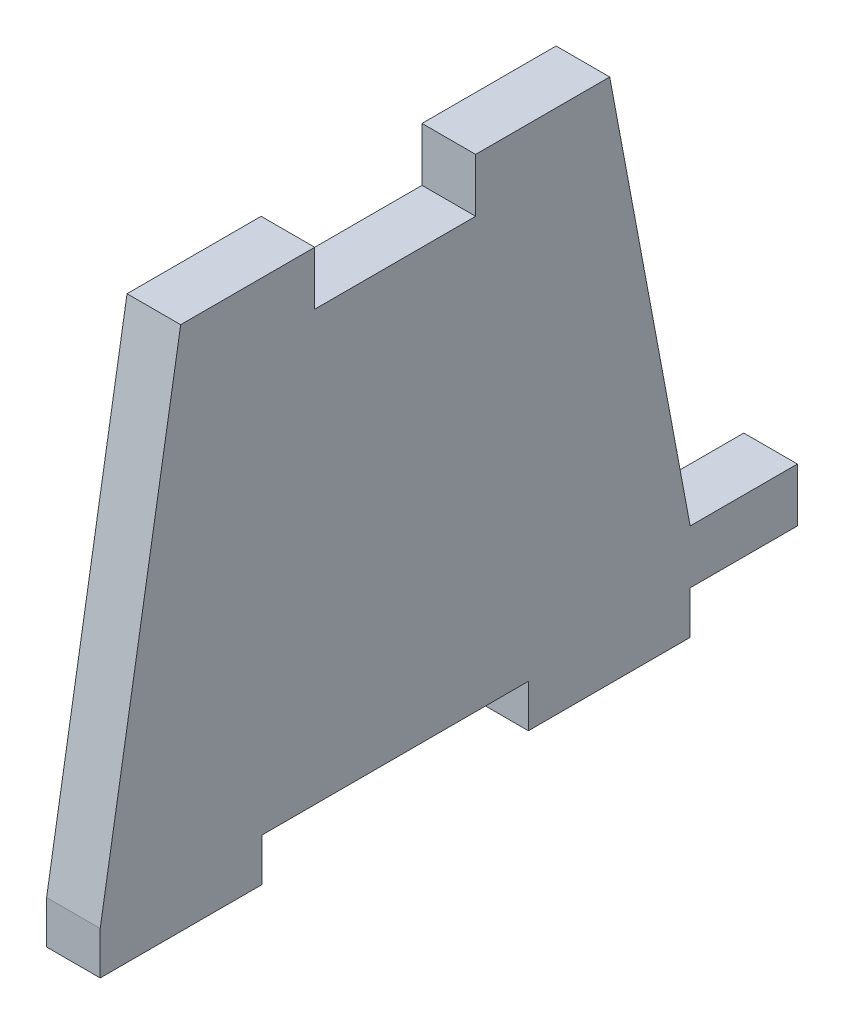
ISO-10303-21;
HEADER;
FILE_DESCRIPTION(('STEP AP214'),'2;1');
FILE_NAME('part.step','',(''),(''),'','','');
FILE_SCHEMA(('AUTOMOTIVE_DESIGN { 1 0 10303 214 1 1 1 1 }'));
ENDSEC;
DATA;
#1=APPLICATION_CONTEXT('core data for automotive mechanical design processes');
#2=APPLICATION_PROTOCOL_DEFINITION('international standard','automotive_design',2000,#1);
#3=PRODUCT_CONTEXT('',#1,'mechanical');
#4=PRODUCT('Part','Part','',(#3));
#5=PRODUCT_RELATED_PRODUCT_CATEGORY('part','',(#4));
#6=PRODUCT_DEFINITION_FORMATION('','',#4);
#7=PRODUCT_DEFINITION_CONTEXT('part definition',#1,'design');
#8=PRODUCT_DEFINITION('design','',#6,#7);
#9=PRODUCT_DEFINITION_SHAPE('','',#8);
#10=(LENGTH_UNIT() NAMED_UNIT(*) SI_UNIT(.MILLI.,.METRE.));
#11=(NAMED_UNIT(*) PLANE_ANGLE_UNIT() SI_UNIT($,.RADIAN.));
#12=(NAMED_UNIT(*) SI_UNIT($,.STERADIAN.) SOLID_ANGLE_UNIT());
#13=UNCERTAINTY_MEASURE_WITH_UNIT(LENGTH_MEASURE(1.E-05),#10,'distance_accuracy_value','');
#14=(GEOMETRIC_REPRESENTATION_CONTEXT(3) GLOBAL_UNCERTAINTY_ASSIGNED_CONTEXT((#13)) GLOBAL_UNIT_ASSIGNED_CONTEXT((#10,
#11,#12)) REPRESENTATION_CONTEXT('',''));
#15=CARTESIAN_POINT('',(0.,0.,0.));
#16=DIRECTION('',(0.,0.,1.));
#17=DIRECTION('',(1.,0.,0.));
#18=AXIS2_PLACEMENT_3D('',#15,#16,#17);
#19=CARTESIAN_POINT('',(1.5875,28.575,4.7625));
#20=DIRECTION('',(0.,-1.,0.));
#21=DIRECTION('',(0.,0.,-1.));
#22=AXIS2_PLACEMENT_3D('',#19,#20,#21);
#23=PLANE('',#22);
#24=DIRECTION('',(0.,0.,1.));
#25=VECTOR('',#24,1.);
#26=CARTESIAN_POINT('',(-1.5875,28.575,4.7625));
#27=LINE('',#26,#25);
#28=CARTESIAN_POINT('',(-1.5875,28.575,4.7625));
#29=VERTEX_POINT('',#28);
#30=CARTESIAN_POINT('',(-1.5875,28.575,12.7));
#31=VERTEX_POINT('',#30);
#32=EDGE_CURVE('E181',#29,#31,#27,.T.);
#33=ORIENTED_EDGE('',*,*,#32,.T.);
#34=DIRECTION('',(-1.,0.,0.));
#35=VECTOR('',#34,1.);
#36=CARTESIAN_POINT('',(1.5875,28.575,12.7));
#37=LINE('',#36,#35);
#38=CARTESIAN_POINT('',(1.5875,28.575,12.7));
#39=VERTEX_POINT('',#38);
#40=EDGE_CURVE('E11',#39,#31,#37,.T.);
#41=ORIENTED_EDGE('',*,*,#40,.F.);
#42=DIRECTION('',(0.,0.,1.));
#43=VECTOR('',#42,1.);
#44=CARTESIAN_POINT('',(1.5875,28.575,4.7625));
#45=LINE('',#44,#43);
#46=CARTESIAN_POINT('',(1.5875,28.575,4.7625));
#47=VERTEX_POINT('',#46);
#48=EDGE_CURVE('E215',#47,#39,#45,.T.);
#49=ORIENTED_EDGE('',*,*,#48,.F.);
#50=DIRECTION('',(-1.,0.,0.));
#51=VECTOR('',#50,1.);
#52=CARTESIAN_POINT('',(1.5875,28.575,4.7625));
#53=LINE('',#52,#51);
#54=EDGE_CURVE('E177',#47,#29,#53,.T.);
#55=ORIENTED_EDGE('',*,*,#54,.T.);
#56=EDGE_LOOP('',(#33,#41,#49,#55));
#57=FACE_BOUND('',#56,.T.);
#58=ADVANCED_FACE('F33',(#57),#23,.F.);
#59=CARTESIAN_POINT('',(1.5875,28.575,12.7));
#60=DIRECTION('',(0.,-0.164398987305357,-0.986393923832144));
#61=DIRECTION('',(0.,0.986393923832144,-0.164398987305357));
#62=AXIS2_PLACEMENT_3D('',#59,#60,#61);
#63=PLANE('',#62);
#64=DIRECTION('',(0.,-0.986393923832144,0.164398987305357));
#65=VECTOR('',#64,1.);
#66=CARTESIAN_POINT('',(-1.5875,28.575,12.7));
#67=LINE('',#66,#65);
#68=CARTESIAN_POINT('',(-1.5875,0.,17.4625));
#69=VERTEX_POINT('',#68);
#70=EDGE_CURVE('E184',#31,#69,#67,.T.);
#71=ORIENTED_EDGE('',*,*,#70,.T.);
#72=DIRECTION('',(-1.,0.,0.));
#73=VECTOR('',#72,1.);
#74=CARTESIAN_POINT('',(1.5875,0.,17.4625));
#75=LINE('',#74,#73);
#76=CARTESIAN_POINT('',(1.5875,0.,17.4625));
#77=VERTEX_POINT('',#76);
#78=EDGE_CURVE('E41',#77,#69,#75,.T.);
#79=ORIENTED_EDGE('',*,*,#78,.F.);
#80=DIRECTION('',(0.,-0.986393923832144,0.164398987305357));
#81=VECTOR('',#80,1.);
#82=CARTESIAN_POINT('',(1.5875,28.575,12.7));
#83=LINE('',#82,#81);
#84=EDGE_CURVE('E115',#39,#77,#83,.T.);
#85=ORIENTED_EDGE('',*,*,#84,.F.);
#86=ORIENTED_EDGE('',*,*,#40,.T.);
#87=EDGE_LOOP('',(#71,#79,#85,#86));
#88=FACE_BOUND('',#87,.T.);
#89=ADVANCED_FACE('F318',(#88),#63,.F.);
#90=CARTESIAN_POINT('',(1.5875,0.,17.4625));
#91=DIRECTION('',(0.,0.,-1.));
#92=DIRECTION('',(-1.,0.,0.));
#93=AXIS2_PLACEMENT_3D('',#90,#91,#92);
#94=PLANE('',#93);
#95=DIRECTION('',(0.,-1.,0.));
#96=VECTOR('',#95,1.);
#97=CARTESIAN_POINT('',(-1.5875,0.,17.4625));
#98=LINE('',#97,#96);
#99=CARTESIAN_POINT('',(-1.5875,-2.54,17.4625));
#100=VERTEX_POINT('',#99);
#101=EDGE_CURVE('E186',#69,#100,#98,.T.);
#102=ORIENTED_EDGE('',*,*,#101,.T.);
#103=DIRECTION('',(-1.,0.,0.));
#104=VECTOR('',#103,1.);
#105=CARTESIAN_POINT('',(1.5875,-2.54,17.4625));
#106=LINE('',#105,#104);
#107=CARTESIAN_POINT('',(1.5875,-2.54,17.4625));
#108=VERTEX_POINT('',#107);
#109=EDGE_CURVE('E249',#108,#100,#106,.T.);
#110=ORIENTED_EDGE('',*,*,#109,.F.);
#111=DIRECTION('',(0.,-1.,0.));
#112=VECTOR('',#111,1.);
#113=CARTESIAN_POINT('',(1.5875,0.,17.4625));
#114=LINE('',#113,#112);
#115=EDGE_CURVE('E257',#77,#108,#114,.T.);
#116=ORIENTED_EDGE('',*,*,#115,.F.);
#117=ORIENTED_EDGE('',*,*,#78,.T.);
#118=EDGE_LOOP('',(#102,#110,#116,#117));
#119=FACE_BOUND('',#118,.T.);
#120=ADVANCED_FACE('F255',(#119),#94,.F.);
#121=CARTESIAN_POINT('',(1.5875,-2.54,17.4625));
#122=DIRECTION('',(0.,1.,0.));
#123=DIRECTION('',(0.,0.,1.));
#124=AXIS2_PLACEMENT_3D('',#121,#122,#123);
#125=PLANE('',#124);
#126=DIRECTION('',(0.,0.,-1.));
#127=VECTOR('',#126,1.);
#128=CARTESIAN_POINT('',(-1.5875,-2.54,17.4625));
#129=LINE('',#128,#127);
#130=CARTESIAN_POINT('',(-1.5875,-2.54,7.8867));
#131=VERTEX_POINT('',#130);
#132=EDGE_CURVE('E188',#100,#131,#129,.T.);
#133=ORIENTED_EDGE('',*,*,#132,.T.);
#134=DIRECTION('',(-1.,0.,0.));
#135=VECTOR('',#134,1.);
#136=CARTESIAN_POINT('',(1.5875,-2.54,7.8867));
#137=LINE('',#136,#135);
#138=CARTESIAN_POINT('',(1.5875,-2.54,7.8867));
#139=VERTEX_POINT('',#138);
#140=EDGE_CURVE('E246',#139,#131,#137,.T.);
#141=ORIENTED_EDGE('',*,*,#140,.F.);
#142=DIRECTION('',(0.,0.,-1.));
#143=VECTOR('',#142,1.);
#144=CARTESIAN_POINT('',(1.5875,-2.54,17.4625));
#145=LINE('',#144,#143);
#146=EDGE_CURVE('E275',#108,#139,#145,.T.);
#147=ORIENTED_EDGE('',*,*,#146,.F.);
#148=ORIENTED_EDGE('',*,*,#109,.T.);
#149=EDGE_LOOP('',(#133,#141,#147,#148));
#150=FACE_BOUND('',#149,.T.);
#151=ADVANCED_FACE('F266',(#150),#125,.F.);
#152=CARTESIAN_POINT('',(1.5875,-2.54,7.8867));
#153=DIRECTION('',(0.,0.,1.));
#154=DIRECTION('',(0.,-1.,0.));
#155=AXIS2_PLACEMENT_3D('',#152,#153,#154);
#156=PLANE('',#155);
#157=DIRECTION('',(0.,1.,0.));
#158=VECTOR('',#157,1.);
#159=CARTESIAN_POINT('',(-1.5875,-2.54,7.8867));
#160=LINE('',#159,#158);
#161=CARTESIAN_POINT('',(-1.5875,0.,7.8867));
#162=VERTEX_POINT('',#161);
#163=EDGE_CURVE('E190',#131,#162,#160,.T.);
#164=ORIENTED_EDGE('',*,*,#163,.T.);
#165=DIRECTION('',(-1.,0.,0.));
#166=VECTOR('',#165,1.);
#167=CARTESIAN_POINT('',(1.5875,0.,7.8867));
#168=LINE('',#167,#166);
#169=CARTESIAN_POINT('',(1.5875,0.,7.8867));
#170=VERTEX_POINT('',#169);
#171=EDGE_CURVE('E243',#170,#162,#168,.T.);
#172=ORIENTED_EDGE('',*,*,#171,.F.);
#173=DIRECTION('',(0.,1.,0.));
#174=VECTOR('',#173,1.);
#175=CARTESIAN_POINT('',(1.5875,-2.54,7.8867));
#176=LINE('',#175,#174);
#177=EDGE_CURVE('E272',#139,#170,#176,.T.);
#178=ORIENTED_EDGE('',*,*,#177,.F.);
#179=ORIENTED_EDGE('',*,*,#140,.T.);
#180=EDGE_LOOP('',(#164,#172,#178,#179));
#181=FACE_BOUND('',#180,.T.);
#182=ADVANCED_FACE('F270',(#181),#156,.F.);
#183=CARTESIAN_POINT('',(1.5875,0.,7.8867));
#184=DIRECTION('',(0.,1.,0.));
#185=DIRECTION('',(0.,0.,1.));
#186=AXIS2_PLACEMENT_3D('',#183,#184,#185);
#187=PLANE('',#186);
#188=DIRECTION('',(0.,0.,-1.));
#189=VECTOR('',#188,1.);
#190=CARTESIAN_POINT('',(-1.5875,0.,7.8867));
#191=LINE('',#190,#189);
#192=CARTESIAN_POINT('',(-1.5875,0.,-7.8867));
#193=VERTEX_POINT('',#192);
#194=EDGE_CURVE('E192',#162,#193,#191,.T.);
#195=ORIENTED_EDGE('',*,*,#194,.T.);
#196=DIRECTION('',(-1.,0.,0.));
#197=VECTOR('',#196,1.);
#198=CARTESIAN_POINT('',(1.5875,0.,-7.8867));
#199=LINE('',#198,#197);
#200=CARTESIAN_POINT('',(1.5875,0.,-7.8867));
#201=VERTEX_POINT('',#200);
#202=EDGE_CURVE('E240',#201,#193,#199,.T.);
#203=ORIENTED_EDGE('',*,*,#202,.F.);
#204=DIRECTION('',(0.,0.,-1.));
#205=VECTOR('',#204,1.);
#206=CARTESIAN_POINT('',(1.5875,0.,7.8867));
#207=LINE('',#206,#205);
#208=EDGE_CURVE('E274',#170,#201,#207,.T.);
#209=ORIENTED_EDGE('',*,*,#208,.F.);
#210=ORIENTED_EDGE('',*,*,#171,.T.);
#211=EDGE_LOOP('',(#195,#203,#209,#210));
#212=FACE_BOUND('',#211,.T.);
#213=ADVANCED_FACE('F331',(#212),#187,.F.);
#214=CARTESIAN_POINT('',(1.5875,0.,-7.8867));
#215=DIRECTION('',(0.,0.,-1.));
#216=DIRECTION('',(0.,1.,0.));
#217=AXIS2_PLACEMENT_3D('',#214,#215,#216);
#218=PLANE('',#217);
#219=DIRECTION('',(0.,-1.,0.));
#220=VECTOR('',#219,1.);
#221=CARTESIAN_POINT('',(-1.5875,0.,-7.8867));
#222=LINE('',#221,#220);
#223=CARTESIAN_POINT('',(-1.5875,-2.54,-7.8867));
#224=VERTEX_POINT('',#223);
#225=EDGE_CURVE('E194',#193,#224,#222,.T.);
#226=ORIENTED_EDGE('',*,*,#225,.T.);
#227=DIRECTION('',(-1.,0.,0.));
#228=VECTOR('',#227,1.);
#229=CARTESIAN_POINT('',(1.5875,-2.54,-7.8867));
#230=LINE('',#229,#228);
#231=CARTESIAN_POINT('',(1.5875,-2.54,-7.8867));
#232=VERTEX_POINT('',#231);
#233=EDGE_CURVE('E237',#232,#224,#230,.T.);
#234=ORIENTED_EDGE('',*,*,#233,.F.);
#235=DIRECTION('',(0.,-1.,0.));
#236=VECTOR('',#235,1.);
#237=CARTESIAN_POINT('',(1.5875,0.,-7.8867));
#238=LINE('',#237,#236);
#239=EDGE_CURVE('E277',#201,#232,#238,.T.);
#240=ORIENTED_EDGE('',*,*,#239,.F.);
#241=ORIENTED_EDGE('',*,*,#202,.T.);
#242=EDGE_LOOP('',(#226,#234,#240,#241));
#243=FACE_BOUND('',#242,.T.);
#244=ADVANCED_FACE('F334',(#243),#218,.F.);
#245=CARTESIAN_POINT('',(1.5875,-2.54,-7.8867));
#246=DIRECTION('',(0.,1.,0.));
#247=DIRECTION('',(0.,0.,1.));
#248=AXIS2_PLACEMENT_3D('',#245,#246,#247);
#249=PLANE('',#248);
#250=DIRECTION('',(0.,0.,-1.));
#251=VECTOR('',#250,1.);
#252=CARTESIAN_POINT('',(-1.5875,-2.54,-7.8867));
#253=LINE('',#252,#251);
#254=CARTESIAN_POINT('',(-1.5875,-2.54,-17.4625));
#255=VERTEX_POINT('',#254);
#256=EDGE_CURVE('E196',#224,#255,#253,.T.);
#257=ORIENTED_EDGE('',*,*,#256,.T.);
#258=DIRECTION('',(-1.,0.,0.));
#259=VECTOR('',#258,1.);
#260=CARTESIAN_POINT('',(1.5875,-2.54,-17.4625));
#261=LINE('',#260,#259);
#262=CARTESIAN_POINT('',(1.5875,-2.54,-17.4625));
#263=VERTEX_POINT('',#262);
#264=EDGE_CURVE('E234',#263,#255,#261,.T.);
#265=ORIENTED_EDGE('',*,*,#264,.F.);
#266=DIRECTION('',(0.,0.,-1.));
#267=VECTOR('',#266,1.);
#268=CARTESIAN_POINT('',(1.5875,-2.54,-7.8867));
#269=LINE('',#268,#267);
#270=EDGE_CURVE('E283',#232,#263,#269,.T.);
#271=ORIENTED_EDGE('',*,*,#270,.F.);
#272=ORIENTED_EDGE('',*,*,#233,.T.);
#273=EDGE_LOOP('',(#257,#265,#271,#272));
#274=FACE_BOUND('',#273,.T.);
#275=ADVANCED_FACE('F338',(#274),#249,.F.);
#276=CARTESIAN_POINT('',(1.5875,-2.54,-17.4625));
#277=DIRECTION('',(0.,0.,1.));
#278=DIRECTION('',(1.,0.,0.));
#279=AXIS2_PLACEMENT_3D('',#276,#277,#278);
#280=PLANE('',#279);
#281=DIRECTION('',(0.,1.,0.));
#282=VECTOR('',#281,1.);
#283=CARTESIAN_POINT('',(-1.5875,-2.54,-17.4625));
#284=LINE('',#283,#282);
#285=CARTESIAN_POINT('',(-1.5875,0.,-17.4625));
#286=VERTEX_POINT('',#285);
#287=EDGE_CURVE('E198',#255,#286,#284,.T.);
#288=ORIENTED_EDGE('',*,*,#287,.T.);
#289=DIRECTION('',(-1.,0.,0.));
#290=VECTOR('',#289,1.);
#291=CARTESIAN_POINT('',(1.5875,0.,-17.4625));
#292=LINE('',#291,#290);
#293=CARTESIAN_POINT('',(1.5875,0.,-17.4625));
#294=VERTEX_POINT('',#293);
#295=EDGE_CURVE('E231',#294,#286,#292,.T.);
#296=ORIENTED_EDGE('',*,*,#295,.F.);
#297=DIRECTION('',(0.,1.,0.));
#298=VECTOR('',#297,1.);
#299=CARTESIAN_POINT('',(1.5875,-2.54,-17.4625));
#300=LINE('',#299,#298);
#301=EDGE_CURVE('E285',#263,#294,#300,.T.);
#302=ORIENTED_EDGE('',*,*,#301,.F.);
#303=ORIENTED_EDGE('',*,*,#264,.T.);
#304=EDGE_LOOP('',(#288,#296,#302,#303));
#305=FACE_BOUND('',#304,.T.);
#306=ADVANCED_FACE('F342',(#305),#280,.F.);
#307=CARTESIAN_POINT('',(1.5875,0.,-17.4625));
#308=DIRECTION('',(0.,1.,0.));
#309=DIRECTION('',(0.,0.,1.));
#310=AXIS2_PLACEMENT_3D('',#307,#308,#309);
#311=PLANE('',#310);
#312=DIRECTION('',(0.,0.,-1.));
#313=VECTOR('',#312,1.);
#314=CARTESIAN_POINT('',(-1.5875,0.,-17.4625));
#315=LINE('',#314,#313);
#316=CARTESIAN_POINT('',(-1.5875,0.,-23.8125));
#317=VERTEX_POINT('',#316);
#318=EDGE_CURVE('E200',#286,#317,#315,.T.);
#319=ORIENTED_EDGE('',*,*,#318,.T.);
#320=DIRECTION('',(-1.,0.,0.));
#321=VECTOR('',#320,1.);
#322=CARTESIAN_POINT('',(1.5875,0.,-23.8125));
#323=LINE('',#322,#321);
#324=CARTESIAN_POINT('',(1.5875,0.,-23.8125));
#325=VERTEX_POINT('',#324);
#326=EDGE_CURVE('E228',#325,#317,#323,.T.);
#327=ORIENTED_EDGE('',*,*,#326,.F.);
#328=DIRECTION('',(0.,0.,-1.));
#329=VECTOR('',#328,1.);
#330=CARTESIAN_POINT('',(1.5875,0.,-17.4625));
#331=LINE('',#330,#329);
#332=EDGE_CURVE('E287',#294,#325,#331,.T.);
#333=ORIENTED_EDGE('',*,*,#332,.F.);
#334=ORIENTED_EDGE('',*,*,#295,.T.);
#335=EDGE_LOOP('',(#319,#327,#333,#334));
#336=FACE_BOUND('',#335,.T.);
#337=ADVANCED_FACE('F346',(#336),#311,.F.);
#338=CARTESIAN_POINT('',(1.5875,0.,-23.8125));
#339=DIRECTION('',(0.,0.,1.));
#340=DIRECTION('',(1.,0.,0.));
#341=AXIS2_PLACEMENT_3D('',#338,#339,#340);
#342=PLANE('',#341);
#343=DIRECTION('',(0.,1.,0.));
#344=VECTOR('',#343,1.);
#345=CARTESIAN_POINT('',(-1.5875,0.,-23.8125));
#346=LINE('',#345,#344);
#347=CARTESIAN_POINT('',(-1.5875,3.175,-23.8125));
#348=VERTEX_POINT('',#347);
#349=EDGE_CURVE('E202',#317,#348,#346,.T.);
#350=ORIENTED_EDGE('',*,*,#349,.T.);
#351=DIRECTION('',(-1.,0.,0.));
#352=VECTOR('',#351,1.);
#353=CARTESIAN_POINT('',(1.5875,3.175,-23.8125));
#354=LINE('',#353,#352);
#355=CARTESIAN_POINT('',(1.5875,3.175,-23.8125));
#356=VERTEX_POINT('',#355);
#357=EDGE_CURVE('E225',#356,#348,#354,.T.);
#358=ORIENTED_EDGE('',*,*,#357,.F.);
#359=DIRECTION('',(0.,1.,0.));
#360=VECTOR('',#359,1.);
#361=CARTESIAN_POINT('',(1.5875,0.,-23.8125));
#362=LINE('',#361,#360);
#363=EDGE_CURVE('E289',#325,#356,#362,.T.);
#364=ORIENTED_EDGE('',*,*,#363,.F.);
#365=ORIENTED_EDGE('',*,*,#326,.T.);
#366=EDGE_LOOP('',(#350,#358,#364,#365));
#367=FACE_BOUND('',#366,.T.);
#368=ADVANCED_FACE('F350',(#367),#342,.F.);
#369=CARTESIAN_POINT('',(1.5875,3.175,-23.8125));
#370=DIRECTION('',(0.,-1.,0.));
#371=DIRECTION('',(0.,0.,-1.));
#372=AXIS2_PLACEMENT_3D('',#369,#370,#371);
#373=PLANE('',#372);
#374=DIRECTION('',(0.,0.,1.));
#375=VECTOR('',#374,1.);
#376=CARTESIAN_POINT('',(-1.5875,3.175,-23.8125));
#377=LINE('',#376,#375);
#378=CARTESIAN_POINT('',(-1.5875,3.175,-17.4625));
#379=VERTEX_POINT('',#378);
#380=EDGE_CURVE('E204',#348,#379,#377,.T.);
#381=ORIENTED_EDGE('',*,*,#380,.T.);
#382=DIRECTION('',(-1.,0.,0.));
#383=VECTOR('',#382,1.);
#384=CARTESIAN_POINT('',(1.5875,3.175,-17.4625));
#385=LINE('',#384,#383);
#386=CARTESIAN_POINT('',(1.5875,3.175,-17.4625));
#387=VERTEX_POINT('',#386);
#388=EDGE_CURVE('E222',#387,#379,#385,.T.);
#389=ORIENTED_EDGE('',*,*,#388,.F.);
#390=DIRECTION('',(0.,0.,1.));
#391=VECTOR('',#390,1.);
#392=CARTESIAN_POINT('',(1.5875,3.175,-23.8125));
#393=LINE('',#392,#391);
#394=EDGE_CURVE('E291',#356,#387,#393,.T.);
#395=ORIENTED_EDGE('',*,*,#394,.F.);
#396=ORIENTED_EDGE('',*,*,#357,.T.);
#397=EDGE_LOOP('',(#381,#389,#395,#396));
#398=FACE_BOUND('',#397,.T.);
#399=ADVANCED_FACE('F354',(#398),#373,.F.);
#400=CARTESIAN_POINT('',(1.5875,3.175,-17.4625));
#401=DIRECTION('',(0.,-0.184288535050185,0.982872186934322));
#402=DIRECTION('',(0.,-0.982872186934322,-0.184288535050185));
#403=AXIS2_PLACEMENT_3D('',#400,#401,#402);
#404=PLANE('',#403);
#405=DIRECTION('',(0.,0.982872186934322,0.184288535050185));
#406=VECTOR('',#405,1.);
#407=CARTESIAN_POINT('',(-1.5875,3.175,-17.4625));
#408=LINE('',#407,#406);
#409=CARTESIAN_POINT('',(-1.5875,28.575,-12.7));
#410=VERTEX_POINT('',#409);
#411=EDGE_CURVE('E206',#379,#410,#408,.T.);
#412=ORIENTED_EDGE('',*,*,#411,.T.);
#413=DIRECTION('',(-1.,0.,0.));
#414=VECTOR('',#413,1.);
#415=CARTESIAN_POINT('',(1.5875,28.575,-12.7));
#416=LINE('',#415,#414);
#417=CARTESIAN_POINT('',(1.5875,28.575,-12.7));
#418=VERTEX_POINT('',#417);
#419=EDGE_CURVE('E219',#418,#410,#416,.T.);
#420=ORIENTED_EDGE('',*,*,#419,.F.);
#421=DIRECTION('',(0.,0.982872186934322,0.184288535050185));
#422=VECTOR('',#421,1.);
#423=CARTESIAN_POINT('',(1.5875,3.175,-17.4625));
#424=LINE('',#423,#422);
#425=EDGE_CURVE('E293',#387,#418,#424,.T.);
#426=ORIENTED_EDGE('',*,*,#425,.F.);
#427=ORIENTED_EDGE('',*,*,#388,.T.);
#428=EDGE_LOOP('',(#412,#420,#426,#427));
#429=FACE_BOUND('',#428,.T.);
#430=ADVANCED_FACE('F299',(#429),#404,.F.);
#431=CARTESIAN_POINT('',(1.5875,28.575,-12.7));
#432=DIRECTION('',(0.,-1.,0.));
#433=DIRECTION('',(0.,0.,-1.));
#434=AXIS2_PLACEMENT_3D('',#431,#432,#433);
#435=PLANE('',#434);
#436=DIRECTION('',(0.,0.,1.));
#437=VECTOR('',#436,1.);
#438=CARTESIAN_POINT('',(-1.5875,28.575,-12.7));
#439=LINE('',#438,#437);
#440=CARTESIAN_POINT('',(-1.5875,28.575,-4.7625));
#441=VERTEX_POINT('',#440);
#442=EDGE_CURVE('E208',#410,#441,#439,.T.);
#443=ORIENTED_EDGE('',*,*,#442,.T.);
#444=DIRECTION('',(-1.,0.,0.));
#445=VECTOR('',#444,1.);
#446=CARTESIAN_POINT('',(1.5875,28.575,-4.7625));
#447=LINE('',#446,#445);
#448=CARTESIAN_POINT('',(1.5875,28.575,-4.7625));
#449=VERTEX_POINT('',#448);
#450=EDGE_CURVE('E167',#449,#441,#447,.T.);
#451=ORIENTED_EDGE('',*,*,#450,.F.);
#452=DIRECTION('',(0.,0.,1.));
#453=VECTOR('',#452,1.);
#454=CARTESIAN_POINT('',(1.5875,28.575,-12.7));
#455=LINE('',#454,#453);
#456=EDGE_CURVE('E172',#418,#449,#455,.T.);
#457=ORIENTED_EDGE('',*,*,#456,.F.);
#458=ORIENTED_EDGE('',*,*,#419,.T.);
#459=EDGE_LOOP('',(#443,#451,#457,#458));
#460=FACE_BOUND('',#459,.T.);
#461=ADVANCED_FACE('F303',(#460),#435,.F.);
#462=CARTESIAN_POINT('',(1.5875,25.4,-4.7625));
#463=DIRECTION('',(0.,0.,1.));
#464=DIRECTION('',(1.,0.,0.));
#465=AXIS2_PLACEMENT_3D('',#462,#463,#464);
#466=PLANE('',#465);
#467=DIRECTION('',(0.,1.,0.));
#468=VECTOR('',#467,1.);
#469=CARTESIAN_POINT('',(-1.5875,25.4,-4.7625));
#470=LINE('',#469,#468);
#471=CARTESIAN_POINT('',(-1.5875,25.4,-4.7625));
#472=VERTEX_POINT('',#471);
#473=EDGE_CURVE('E162',#472,#441,#470,.T.);
#474=ORIENTED_EDGE('',*,*,#473,.F.);
#475=DIRECTION('',(-1.,0.,0.));
#476=VECTOR('',#475,1.);
#477=CARTESIAN_POINT('',(1.5875,25.4,-4.7625));
#478=LINE('',#477,#476);
#479=CARTESIAN_POINT('',(1.5875,25.4,-4.7625));
#480=VERTEX_POINT('',#479);
#481=EDGE_CURVE('E157',#480,#472,#478,.T.);
#482=ORIENTED_EDGE('',*,*,#481,.F.);
#483=DIRECTION('',(0.,1.,0.));
#484=VECTOR('',#483,1.);
#485=CARTESIAN_POINT('',(1.5875,25.4,-4.7625));
#486=LINE('',#485,#484);
#487=EDGE_CURVE('E160',#480,#449,#486,.T.);
#488=ORIENTED_EDGE('',*,*,#487,.T.);
#489=ORIENTED_EDGE('',*,*,#450,.T.);
#490=EDGE_LOOP('',(#474,#482,#488,#489));
#491=FACE_BOUND('',#490,.T.);
#492=ADVANCED_FACE('F159',(#491),#466,.T.);
#493=CARTESIAN_POINT('',(1.5875,25.4,4.7625));
#494=DIRECTION('',(0.,1.,0.));
#495=DIRECTION('',(0.,0.,1.));
#496=AXIS2_PLACEMENT_3D('',#493,#494,#495);
#497=PLANE('',#496);
#498=DIRECTION('',(0.,0.,-1.));
#499=VECTOR('',#498,1.);
#500=CARTESIAN_POINT('',(-1.5875,25.4,4.7625));
#501=LINE('',#500,#499);
#502=CARTESIAN_POINT('',(-1.5875,25.4,4.7625));
#503=VERTEX_POINT('',#502);
#504=EDGE_CURVE('E212',#503,#472,#501,.T.);
#505=ORIENTED_EDGE('',*,*,#504,.F.);
#506=DIRECTION('',(-1.,0.,0.));
#507=VECTOR('',#506,1.);
#508=CARTESIAN_POINT('',(1.5875,25.4,4.7625));
#509=LINE('',#508,#507);
#510=CARTESIAN_POINT('',(1.5875,25.4,4.7625));
#511=VERTEX_POINT('',#510);
#512=EDGE_CURVE('E104',#511,#503,#509,.T.);
#513=ORIENTED_EDGE('',*,*,#512,.F.);
#514=DIRECTION('',(0.,0.,-1.));
#515=VECTOR('',#514,1.);
#516=CARTESIAN_POINT('',(1.5875,25.4,4.7625));
#517=LINE('',#516,#515);
#518=EDGE_CURVE('E170',#511,#480,#517,.T.);
#519=ORIENTED_EDGE('',*,*,#518,.T.);
#520=ORIENTED_EDGE('',*,*,#481,.T.);
#521=EDGE_LOOP('',(#505,#513,#519,#520));
#522=FACE_BOUND('',#521,.T.);
#523=ADVANCED_FACE('F175',(#522),#497,.T.);
#524=CARTESIAN_POINT('',(1.5875,25.4,4.7625));
#525=DIRECTION('',(0.,0.,1.));
#526=DIRECTION('',(1.,0.,0.));
#527=AXIS2_PLACEMENT_3D('',#524,#525,#526);
#528=PLANE('',#527);
#529=DIRECTION('',(0.,1.,0.));
#530=VECTOR('',#529,1.);
#531=CARTESIAN_POINT('',(-1.5875,25.4,4.7625));
#532=LINE('',#531,#530);
#533=EDGE_CURVE('E107',#503,#29,#532,.T.);
#534=ORIENTED_EDGE('',*,*,#533,.T.);
#535=ORIENTED_EDGE('',*,*,#54,.F.);
#536=DIRECTION('',(0.,1.,0.));
#537=VECTOR('',#536,1.);
#538=CARTESIAN_POINT('',(1.5875,25.4,4.7625));
#539=LINE('',#538,#537);
#540=EDGE_CURVE('E49',#511,#47,#539,.T.);
#541=ORIENTED_EDGE('',*,*,#540,.F.);
#542=ORIENTED_EDGE('',*,*,#512,.T.);
#543=EDGE_LOOP('',(#534,#535,#541,#542));
#544=FACE_BOUND('',#543,.T.);
#545=ADVANCED_FACE('F307',(#544),#528,.F.);
#546=CARTESIAN_POINT('',(1.5875,0.,0.));
#547=DIRECTION('',(1.,0.,0.));
#548=DIRECTION('',(0.,0.,-1.));
#549=AXIS2_PLACEMENT_3D('',#546,#547,#548);
#550=PLANE('',#549);
#551=ORIENTED_EDGE('',*,*,#48,.T.);
#552=ORIENTED_EDGE('',*,*,#84,.T.);
#553=ORIENTED_EDGE('',*,*,#115,.T.);
#554=ORIENTED_EDGE('',*,*,#146,.T.);
#555=ORIENTED_EDGE('',*,*,#177,.T.);
#556=ORIENTED_EDGE('',*,*,#208,.T.);
#557=ORIENTED_EDGE('',*,*,#239,.T.);
#558=ORIENTED_EDGE('',*,*,#270,.T.);
#559=ORIENTED_EDGE('',*,*,#301,.T.);
#560=ORIENTED_EDGE('',*,*,#332,.T.);
#561=ORIENTED_EDGE('',*,*,#363,.T.);
#562=ORIENTED_EDGE('',*,*,#394,.T.);
#563=ORIENTED_EDGE('',*,*,#425,.T.);
#564=ORIENTED_EDGE('',*,*,#456,.T.);
#565=ORIENTED_EDGE('',*,*,#487,.F.);
#566=ORIENTED_EDGE('',*,*,#518,.F.);
#567=ORIENTED_EDGE('',*,*,#540,.T.);
#568=EDGE_LOOP('',(#551,#552,#553,#554,#555,#556,#557,#558,#559,#560,#561,#562,#563,#564,#565,
#566,#567));
#569=FACE_BOUND('',#568,.T.);
#570=ADVANCED_FACE('F169',(#569),#550,.T.);
#571=CARTESIAN_POINT('',(-1.5875,0.,0.));
#572=DIRECTION('',(1.,0.,0.));
#573=DIRECTION('',(0.,0.,-1.));
#574=AXIS2_PLACEMENT_3D('',#571,#572,#573);
#575=PLANE('',#574);
#576=ORIENTED_EDGE('',*,*,#32,.F.);
#577=ORIENTED_EDGE('',*,*,#533,.F.);
#578=ORIENTED_EDGE('',*,*,#504,.T.);
#579=ORIENTED_EDGE('',*,*,#473,.T.);
#580=ORIENTED_EDGE('',*,*,#442,.F.);
#581=ORIENTED_EDGE('',*,*,#411,.F.);
#582=ORIENTED_EDGE('',*,*,#380,.F.);
#583=ORIENTED_EDGE('',*,*,#349,.F.);
#584=ORIENTED_EDGE('',*,*,#318,.F.);
#585=ORIENTED_EDGE('',*,*,#287,.F.);
#586=ORIENTED_EDGE('',*,*,#256,.F.);
#587=ORIENTED_EDGE('',*,*,#225,.F.);
#588=ORIENTED_EDGE('',*,*,#194,.F.);
#589=ORIENTED_EDGE('',*,*,#163,.F.);
#590=ORIENTED_EDGE('',*,*,#132,.F.);
#591=ORIENTED_EDGE('',*,*,#101,.F.);
#592=ORIENTED_EDGE('',*,*,#70,.F.);
#593=EDGE_LOOP('',(#576,#577,#578,#579,#580,#581,#582,#583,#584,#585,#586,#587,#588,#589,#590,
#591,#592));
#594=FACE_BOUND('',#593,.T.);
#595=ADVANCED_FACE('F261',(#594),#575,.F.);
#596=CLOSED_SHELL('',(#58,#89,#120,#151,#182,#213,#244,#275,#306,#337,#368,#399,#430,#461,#492,
#523,#545,#570,#595));
#597=MANIFOLD_SOLID_BREP('B2',#596);
#598=ADVANCED_BREP_SHAPE_REPRESENTATION('',(#18,#597),#14);
#599=SHAPE_DEFINITION_REPRESENTATION(#9,#598);
ENDSEC;
END-ISO-10303-21;
